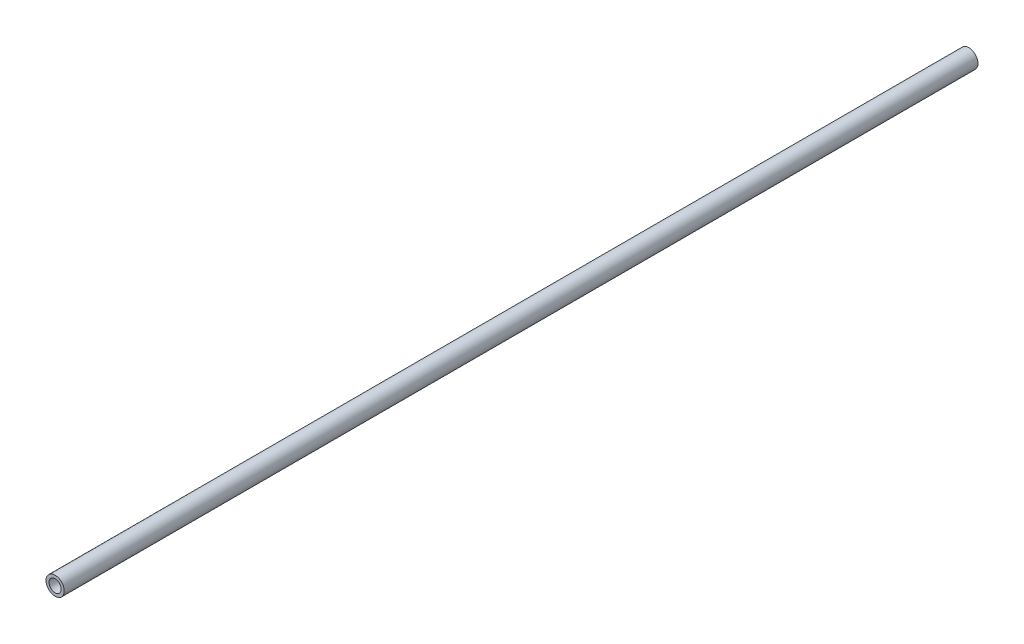
ISO-10303-21;
HEADER;
FILE_DESCRIPTION(('STEP AP214'),'2;1');
FILE_NAME('part.step','',(''),(''),'','','');
FILE_SCHEMA(('AUTOMOTIVE_DESIGN { 1 0 10303 214 1 1 1 1 }'));
ENDSEC;
DATA;
#1=APPLICATION_CONTEXT('core data for automotive mechanical design processes');
#2=APPLICATION_PROTOCOL_DEFINITION('international standard','automotive_design',2000,#1);
#3=PRODUCT_CONTEXT('',#1,'mechanical');
#4=PRODUCT('Part','Part','',(#3));
#5=PRODUCT_RELATED_PRODUCT_CATEGORY('part','',(#4));
#6=PRODUCT_DEFINITION_FORMATION('','',#4);
#7=PRODUCT_DEFINITION_CONTEXT('part definition',#1,'design');
#8=PRODUCT_DEFINITION('design','',#6,#7);
#9=PRODUCT_DEFINITION_SHAPE('','',#8);
#10=(LENGTH_UNIT() NAMED_UNIT(*) SI_UNIT(.MILLI.,.METRE.));
#11=(NAMED_UNIT(*) PLANE_ANGLE_UNIT() SI_UNIT($,.RADIAN.));
#12=(NAMED_UNIT(*) SI_UNIT($,.STERADIAN.) SOLID_ANGLE_UNIT());
#13=UNCERTAINTY_MEASURE_WITH_UNIT(LENGTH_MEASURE(1.E-05),#10,'distance_accuracy_value','');
#14=(GEOMETRIC_REPRESENTATION_CONTEXT(3) GLOBAL_UNCERTAINTY_ASSIGNED_CONTEXT((#13)) GLOBAL_UNIT_ASSIGNED_CONTEXT((#10,
#11,#12)) REPRESENTATION_CONTEXT('',''));
#15=CARTESIAN_POINT('',(0.,0.,0.));
#16=DIRECTION('',(0.,0.,1.));
#17=DIRECTION('',(1.,0.,0.));
#18=AXIS2_PLACEMENT_3D('',#15,#16,#17);
#19=CARTESIAN_POINT('',(0.,0.,762.));
#20=DIRECTION('',(0.,0.,1.));
#21=DIRECTION('',(1.,0.,0.));
#22=AXIS2_PLACEMENT_3D('',#19,#20,#21);
#23=PLANE('',#22);
#24=CARTESIAN_POINT('',(0.,0.,762.));
#25=DIRECTION('',(0.,0.,1.));
#26=DIRECTION('',(1.,0.,0.));
#27=AXIS2_PLACEMENT_3D('',#24,#25,#26);
#28=CIRCLE('',#27,7.62);
#29=CARTESIAN_POINT('',(7.62,0.,762.));
#30=VERTEX_POINT('',#29);
#31=EDGE_CURVE('E10',#30,#30,#28,.T.);
#32=ORIENTED_EDGE('',*,*,#31,.T.);
#33=EDGE_LOOP('',(#32));
#34=FACE_BOUND('',#33,.T.);
#35=CARTESIAN_POINT('',(0.,0.,762.));
#36=DIRECTION('',(0.,0.,1.));
#37=DIRECTION('',(1.,0.,0.));
#38=AXIS2_PLACEMENT_3D('',#35,#36,#37);
#39=CIRCLE('',#38,5.08);
#40=CARTESIAN_POINT('',(5.08,0.,762.));
#41=VERTEX_POINT('',#40);
#42=EDGE_CURVE('E39',#41,#41,#39,.T.);
#43=ORIENTED_EDGE('',*,*,#42,.F.);
#44=EDGE_LOOP('',(#43));
#45=FACE_BOUND('',#44,.T.);
#46=ADVANCED_FACE('F28',(#34,#45),#23,.T.);
#47=CARTESIAN_POINT('',(0.,0.,0.));
#48=DIRECTION('',(0.,0.,1.));
#49=DIRECTION('',(1.,0.,0.));
#50=AXIS2_PLACEMENT_3D('',#47,#48,#49);
#51=PLANE('',#50);
#52=CARTESIAN_POINT('',(0.,0.,0.));
#53=DIRECTION('',(0.,0.,1.));
#54=DIRECTION('',(1.,0.,0.));
#55=AXIS2_PLACEMENT_3D('',#52,#53,#54);
#56=CIRCLE('',#55,7.62);
#57=CARTESIAN_POINT('',(7.62,0.,0.));
#58=VERTEX_POINT('',#57);
#59=EDGE_CURVE('E32',#58,#58,#56,.T.);
#60=ORIENTED_EDGE('',*,*,#59,.F.);
#61=EDGE_LOOP('',(#60));
#62=FACE_BOUND('',#61,.T.);
#63=CARTESIAN_POINT('',(0.,0.,0.));
#64=DIRECTION('',(0.,0.,1.));
#65=DIRECTION('',(1.,0.,0.));
#66=AXIS2_PLACEMENT_3D('',#63,#64,#65);
#67=CIRCLE('',#66,5.08);
#68=CARTESIAN_POINT('',(5.08,0.,0.));
#69=VERTEX_POINT('',#68);
#70=EDGE_CURVE('E41',#69,#69,#67,.T.);
#71=ORIENTED_EDGE('',*,*,#70,.T.);
#72=EDGE_LOOP('',(#71));
#73=FACE_BOUND('',#72,.T.);
#74=ADVANCED_FACE('F51',(#62,#73),#51,.F.);
#75=CARTESIAN_POINT('',(0.,0.,762.));
#76=DIRECTION('',(0.,0.,-1.));
#77=DIRECTION('',(-1.,0.,0.));
#78=AXIS2_PLACEMENT_3D('',#75,#76,#77);
#79=CYLINDRICAL_SURFACE('',#78,7.62);
#80=ORIENTED_EDGE('',*,*,#31,.F.);
#81=EDGE_LOOP('',(#80));
#82=FACE_BOUND('',#81,.T.);
#83=ORIENTED_EDGE('',*,*,#59,.T.);
#84=EDGE_LOOP('',(#83));
#85=FACE_BOUND('',#84,.T.);
#86=ADVANCED_FACE('F30',(#82,#85),#79,.T.);
#87=CARTESIAN_POINT('',(0.,0.,762.));
#88=DIRECTION('',(0.,0.,-1.));
#89=DIRECTION('',(-1.,0.,0.));
#90=AXIS2_PLACEMENT_3D('',#87,#88,#89);
#91=CYLINDRICAL_SURFACE('',#90,5.08);
#92=ORIENTED_EDGE('',*,*,#42,.T.);
#93=EDGE_LOOP('',(#92));
#94=FACE_BOUND('',#93,.T.);
#95=ORIENTED_EDGE('',*,*,#70,.F.);
#96=EDGE_LOOP('',(#95));
#97=FACE_BOUND('',#96,.T.);
#98=ADVANCED_FACE('F47',(#94,#97),#91,.F.);
#99=CLOSED_SHELL('',(#46,#74,#86,#98));
#100=MANIFOLD_SOLID_BREP('B2',#99);
#101=ADVANCED_BREP_SHAPE_REPRESENTATION('',(#18,#100),#14);
#102=SHAPE_DEFINITION_REPRESENTATION(#9,#101);
ENDSEC;
END-ISO-10303-21;
